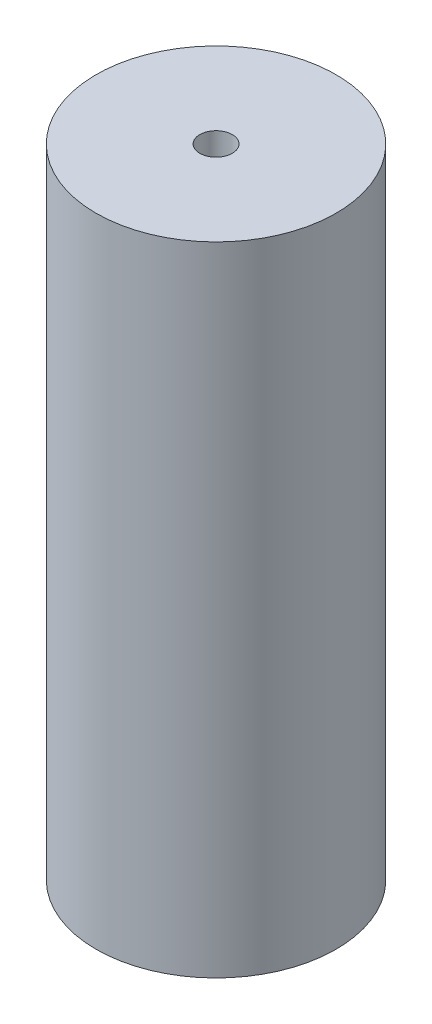
ISO-10303-21;
HEADER;
FILE_DESCRIPTION(('STEP AP214'),'2;1');
FILE_NAME('part.step','',(''),(''),'','','');
FILE_SCHEMA(('AUTOMOTIVE_DESIGN { 1 0 10303 214 1 1 1 1 }'));
ENDSEC;
DATA;
#1=APPLICATION_CONTEXT('core data for automotive mechanical design processes');
#2=APPLICATION_PROTOCOL_DEFINITION('international standard','automotive_design',2000,#1);
#3=PRODUCT_CONTEXT('',#1,'mechanical');
#4=PRODUCT('Part','Part','',(#3));
#5=PRODUCT_RELATED_PRODUCT_CATEGORY('part','',(#4));
#6=PRODUCT_DEFINITION_FORMATION('','',#4);
#7=PRODUCT_DEFINITION_CONTEXT('part definition',#1,'design');
#8=PRODUCT_DEFINITION('design','',#6,#7);
#9=PRODUCT_DEFINITION_SHAPE('','',#8);
#10=(LENGTH_UNIT() NAMED_UNIT(*) SI_UNIT(.MILLI.,.METRE.));
#11=(NAMED_UNIT(*) PLANE_ANGLE_UNIT() SI_UNIT($,.RADIAN.));
#12=(NAMED_UNIT(*) SI_UNIT($,.STERADIAN.) SOLID_ANGLE_UNIT());
#13=UNCERTAINTY_MEASURE_WITH_UNIT(LENGTH_MEASURE(1.E-05),#10,'distance_accuracy_value','');
#14=(GEOMETRIC_REPRESENTATION_CONTEXT(3) GLOBAL_UNCERTAINTY_ASSIGNED_CONTEXT((#13)) GLOBAL_UNIT_ASSIGNED_CONTEXT((#10,
#11,#12)) REPRESENTATION_CONTEXT('',''));
#15=CARTESIAN_POINT('',(0.,0.,0.));
#16=DIRECTION('',(0.,0.,1.));
#17=DIRECTION('',(1.,0.,0.));
#18=AXIS2_PLACEMENT_3D('',#15,#16,#17);
#19=CARTESIAN_POINT('',(0.,127.,0.));
#20=DIRECTION('',(0.,-1.,0.));
#21=DIRECTION('',(0.,0.,-1.));
#22=AXIS2_PLACEMENT_3D('',#19,#20,#21);
#23=CYLINDRICAL_SURFACE('',#22,23.9141);
#24=CARTESIAN_POINT('',(0.,127.,0.));
#25=DIRECTION('',(0.,1.,0.));
#26=DIRECTION('',(0.,0.,1.));
#27=AXIS2_PLACEMENT_3D('',#24,#25,#26);
#28=CIRCLE('',#27,23.9141);
#29=CARTESIAN_POINT('',(0.,127.,23.9141));
#30=VERTEX_POINT('',#29);
#31=EDGE_CURVE('E10',#30,#30,#28,.T.);
#32=ORIENTED_EDGE('',*,*,#31,.F.);
#33=EDGE_LOOP('',(#32));
#34=FACE_BOUND('',#33,.T.);
#35=CARTESIAN_POINT('',(0.,0.,0.));
#36=DIRECTION('',(0.,1.,0.));
#37=DIRECTION('',(0.,0.,1.));
#38=AXIS2_PLACEMENT_3D('',#35,#36,#37);
#39=CIRCLE('',#38,23.9141);
#40=CARTESIAN_POINT('',(0.,0.,23.9141));
#41=VERTEX_POINT('',#40);
#42=EDGE_CURVE('E44',#41,#41,#39,.T.);
#43=ORIENTED_EDGE('',*,*,#42,.T.);
#44=EDGE_LOOP('',(#43));
#45=FACE_BOUND('',#44,.T.);
#46=ADVANCED_FACE('F41',(#34,#45),#23,.T.);
#47=CARTESIAN_POINT('',(0.,127.,0.));
#48=DIRECTION('',(0.,1.,0.));
#49=DIRECTION('',(0.,0.,1.));
#50=AXIS2_PLACEMENT_3D('',#47,#48,#49);
#51=PLANE('',#50);
#52=CARTESIAN_POINT('',(0.,127.,0.));
#53=DIRECTION('',(0.,1.,0.));
#54=DIRECTION('',(0.,0.,1.));
#55=AXIS2_PLACEMENT_3D('',#52,#53,#54);
#56=CIRCLE('',#55,3.2385);
#57=CARTESIAN_POINT('',(0.,127.,3.2385));
#58=VERTEX_POINT('',#57);
#59=EDGE_CURVE('E58',#58,#58,#56,.T.);
#60=ORIENTED_EDGE('',*,*,#59,.F.);
#61=EDGE_LOOP('',(#60));
#62=FACE_BOUND('',#61,.T.);
#63=ORIENTED_EDGE('',*,*,#31,.T.);
#64=EDGE_LOOP('',(#63));
#65=FACE_BOUND('',#64,.T.);
#66=ADVANCED_FACE('F66',(#62,#65),#51,.T.);
#67=CARTESIAN_POINT('',(0.,0.,0.));
#68=DIRECTION('',(0.,1.,0.));
#69=DIRECTION('',(0.,0.,1.));
#70=AXIS2_PLACEMENT_3D('',#67,#68,#69);
#71=PLANE('',#70);
#72=CARTESIAN_POINT('',(0.,0.,0.));
#73=DIRECTION('',(0.,1.,0.));
#74=DIRECTION('',(0.,0.,1.));
#75=AXIS2_PLACEMENT_3D('',#72,#73,#74);
#76=CIRCLE('',#75,3.2385);
#77=CARTESIAN_POINT('',(0.,0.,3.2385));
#78=VERTEX_POINT('',#77);
#79=EDGE_CURVE('E53',#78,#78,#76,.F.);
#80=ORIENTED_EDGE('',*,*,#79,.F.);
#81=EDGE_LOOP('',(#80));
#82=FACE_BOUND('',#81,.T.);
#83=ORIENTED_EDGE('',*,*,#42,.F.);
#84=EDGE_LOOP('',(#83));
#85=FACE_BOUND('',#84,.T.);
#86=ADVANCED_FACE('F68',(#82,#85),#71,.F.);
#87=CARTESIAN_POINT('',(0.,-0.001000000000001,0.));
#88=DIRECTION('',(0.,1.,0.));
#89=DIRECTION('',(0.,0.,1.));
#90=AXIS2_PLACEMENT_3D('',#87,#88,#89);
#91=CYLINDRICAL_SURFACE('',#90,3.2385);
#92=ORIENTED_EDGE('',*,*,#59,.T.);
#93=EDGE_LOOP('',(#92));
#94=FACE_BOUND('',#93,.T.);
#95=ORIENTED_EDGE('',*,*,#79,.T.);
#96=EDGE_LOOP('',(#95));
#97=FACE_BOUND('',#96,.T.);
#98=ADVANCED_FACE('F63',(#94,#97),#91,.F.);
#99=CLOSED_SHELL('',(#46,#66,#86,#98));
#100=MANIFOLD_SOLID_BREP('B2',#99);
#101=ADVANCED_BREP_SHAPE_REPRESENTATION('',(#18,#100),#14);
#102=SHAPE_DEFINITION_REPRESENTATION(#9,#101);
ENDSEC;
END-ISO-10303-21;
